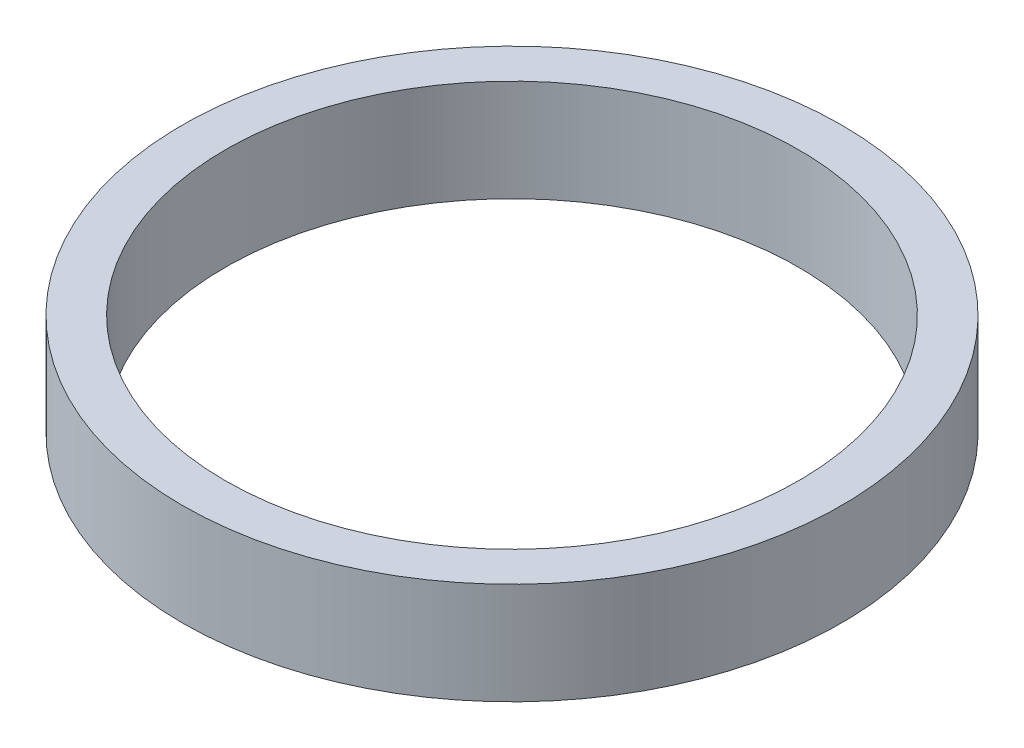
ISO-10303-21;
HEADER;
FILE_DESCRIPTION(('STEP AP214'),'2;1');
FILE_NAME('part.step','',(''),(''),'','','');
FILE_SCHEMA(('AUTOMOTIVE_DESIGN { 1 0 10303 214 1 1 1 1 }'));
ENDSEC;
DATA;
#1=APPLICATION_CONTEXT('core data for automotive mechanical design processes');
#2=APPLICATION_PROTOCOL_DEFINITION('international standard','automotive_design',2000,#1);
#3=PRODUCT_CONTEXT('',#1,'mechanical');
#4=PRODUCT('Part','Part','',(#3));
#5=PRODUCT_RELATED_PRODUCT_CATEGORY('part','',(#4));
#6=PRODUCT_DEFINITION_FORMATION('','',#4);
#7=PRODUCT_DEFINITION_CONTEXT('part definition',#1,'design');
#8=PRODUCT_DEFINITION('design','',#6,#7);
#9=PRODUCT_DEFINITION_SHAPE('','',#8);
#10=(LENGTH_UNIT() NAMED_UNIT(*) SI_UNIT(.MILLI.,.METRE.));
#11=(NAMED_UNIT(*) PLANE_ANGLE_UNIT() SI_UNIT($,.RADIAN.));
#12=(NAMED_UNIT(*) SI_UNIT($,.STERADIAN.) SOLID_ANGLE_UNIT());
#13=UNCERTAINTY_MEASURE_WITH_UNIT(LENGTH_MEASURE(1.E-05),#10,'distance_accuracy_value','');
#14=(GEOMETRIC_REPRESENTATION_CONTEXT(3) GLOBAL_UNCERTAINTY_ASSIGNED_CONTEXT((#13)) GLOBAL_UNIT_ASSIGNED_CONTEXT((#10,
#11,#12)) REPRESENTATION_CONTEXT('',''));
#15=CARTESIAN_POINT('',(0.,0.,0.));
#16=DIRECTION('',(0.,0.,1.));
#17=DIRECTION('',(1.,0.,0.));
#18=AXIS2_PLACEMENT_3D('',#15,#16,#17);
#19=CARTESIAN_POINT('',(0.,19.,0.));
#20=DIRECTION('',(0.,1.,0.));
#21=DIRECTION('',(0.,0.,1.));
#22=AXIS2_PLACEMENT_3D('',#19,#20,#21);
#23=PLANE('',#22);
#24=CARTESIAN_POINT('',(0.,19.,0.));
#25=DIRECTION('',(0.,1.,0.));
#26=DIRECTION('',(0.,0.,1.));
#27=AXIS2_PLACEMENT_3D('',#24,#25,#26);
#28=CIRCLE('',#27,61.5);
#29=CARTESIAN_POINT('',(0.,19.,61.5));
#30=VERTEX_POINT('',#29);
#31=EDGE_CURVE('E10',#30,#30,#28,.T.);
#32=ORIENTED_EDGE('',*,*,#31,.T.);
#33=EDGE_LOOP('',(#32));
#34=FACE_BOUND('',#33,.T.);
#35=CARTESIAN_POINT('',(0.,19.,0.));
#36=DIRECTION('',(0.,1.,0.));
#37=DIRECTION('',(0.,0.,1.));
#38=AXIS2_PLACEMENT_3D('',#35,#36,#37);
#39=CIRCLE('',#38,53.5);
#40=CARTESIAN_POINT('',(0.,19.,53.5));
#41=VERTEX_POINT('',#40);
#42=EDGE_CURVE('E46',#41,#41,#39,.T.);
#43=ORIENTED_EDGE('',*,*,#42,.F.);
#44=EDGE_LOOP('',(#43));
#45=FACE_BOUND('',#44,.T.);
#46=ADVANCED_FACE('F35',(#34,#45),#23,.T.);
#47=CARTESIAN_POINT('',(0.,0.,0.));
#48=DIRECTION('',(0.,1.,0.));
#49=DIRECTION('',(0.,0.,1.));
#50=AXIS2_PLACEMENT_3D('',#47,#48,#49);
#51=PLANE('',#50);
#52=CARTESIAN_POINT('',(0.,0.,0.));
#53=DIRECTION('',(0.,1.,0.));
#54=DIRECTION('',(0.,0.,1.));
#55=AXIS2_PLACEMENT_3D('',#52,#53,#54);
#56=CIRCLE('',#55,61.5);
#57=CARTESIAN_POINT('',(0.,0.,61.5));
#58=VERTEX_POINT('',#57);
#59=EDGE_CURVE('E39',#58,#58,#56,.T.);
#60=ORIENTED_EDGE('',*,*,#59,.F.);
#61=EDGE_LOOP('',(#60));
#62=FACE_BOUND('',#61,.T.);
#63=CARTESIAN_POINT('',(0.,0.,0.));
#64=DIRECTION('',(0.,1.,0.));
#65=DIRECTION('',(0.,0.,1.));
#66=AXIS2_PLACEMENT_3D('',#63,#64,#65);
#67=CIRCLE('',#66,53.5);
#68=CARTESIAN_POINT('',(0.,0.,53.5));
#69=VERTEX_POINT('',#68);
#70=EDGE_CURVE('E48',#69,#69,#67,.T.);
#71=ORIENTED_EDGE('',*,*,#70,.T.);
#72=EDGE_LOOP('',(#71));
#73=FACE_BOUND('',#72,.T.);
#74=ADVANCED_FACE('F58',(#62,#73),#51,.F.);
#75=CARTESIAN_POINT('',(0.,19.,0.));
#76=DIRECTION('',(0.,-1.,0.));
#77=DIRECTION('',(0.,0.,-1.));
#78=AXIS2_PLACEMENT_3D('',#75,#76,#77);
#79=CYLINDRICAL_SURFACE('',#78,61.5);
#80=ORIENTED_EDGE('',*,*,#31,.F.);
#81=EDGE_LOOP('',(#80));
#82=FACE_BOUND('',#81,.T.);
#83=ORIENTED_EDGE('',*,*,#59,.T.);
#84=EDGE_LOOP('',(#83));
#85=FACE_BOUND('',#84,.T.);
#86=ADVANCED_FACE('F37',(#82,#85),#79,.T.);
#87=CARTESIAN_POINT('',(0.,19.,0.));
#88=DIRECTION('',(0.,-1.,0.));
#89=DIRECTION('',(0.,0.,-1.));
#90=AXIS2_PLACEMENT_3D('',#87,#88,#89);
#91=CYLINDRICAL_SURFACE('',#90,53.5);
#92=ORIENTED_EDGE('',*,*,#42,.T.);
#93=EDGE_LOOP('',(#92));
#94=FACE_BOUND('',#93,.T.);
#95=ORIENTED_EDGE('',*,*,#70,.F.);
#96=EDGE_LOOP('',(#95));
#97=FACE_BOUND('',#96,.T.);
#98=ADVANCED_FACE('F54',(#94,#97),#91,.F.);
#99=CLOSED_SHELL('',(#46,#74,#86,#98));
#100=MANIFOLD_SOLID_BREP('B2',#99);
#101=ADVANCED_BREP_SHAPE_REPRESENTATION('',(#18,#100),#14);
#102=SHAPE_DEFINITION_REPRESENTATION(#9,#101);
ENDSEC;
END-ISO-10303-21;
